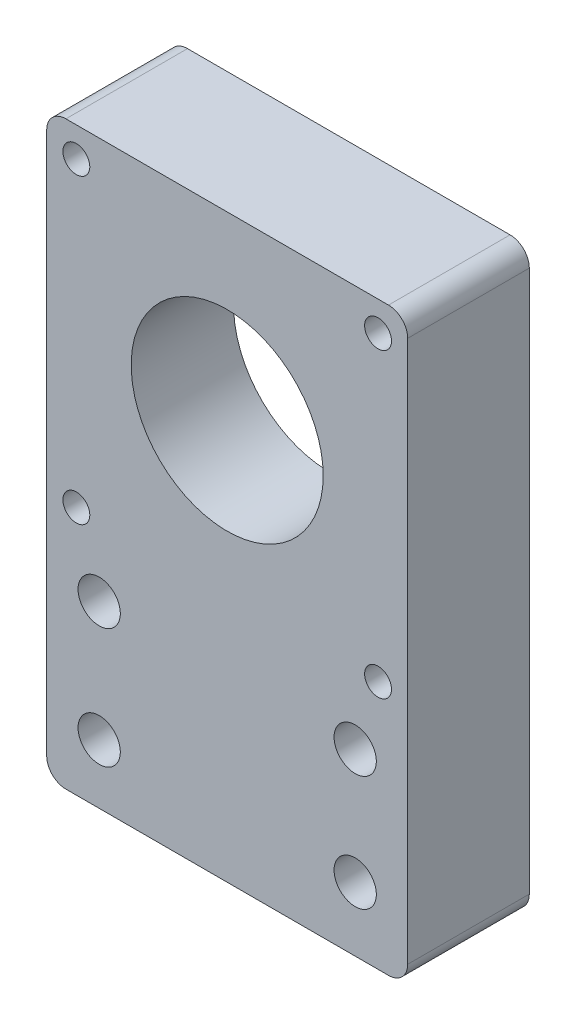
ISO-10303-21;
HEADER;
FILE_DESCRIPTION(('STEP AP214'),'2;1');
FILE_NAME('part.step','',(''),(''),'','','');
FILE_SCHEMA(('AUTOMOTIVE_DESIGN { 1 0 10303 214 1 1 1 1 }'));
ENDSEC;
DATA;
#1=APPLICATION_CONTEXT('core data for automotive mechanical design processes');
#2=APPLICATION_PROTOCOL_DEFINITION('international standard','automotive_design',2000,#1);
#3=PRODUCT_CONTEXT('',#1,'mechanical');
#4=PRODUCT('Part','Part','',(#3));
#5=PRODUCT_RELATED_PRODUCT_CATEGORY('part','',(#4));
#6=PRODUCT_DEFINITION_FORMATION('','',#4);
#7=PRODUCT_DEFINITION_CONTEXT('part definition',#1,'design');
#8=PRODUCT_DEFINITION('design','',#6,#7);
#9=PRODUCT_DEFINITION_SHAPE('','',#8);
#10=(LENGTH_UNIT() NAMED_UNIT(*) SI_UNIT(.MILLI.,.METRE.));
#11=(NAMED_UNIT(*) PLANE_ANGLE_UNIT() SI_UNIT($,.RADIAN.));
#12=(NAMED_UNIT(*) SI_UNIT($,.STERADIAN.) SOLID_ANGLE_UNIT());
#13=UNCERTAINTY_MEASURE_WITH_UNIT(LENGTH_MEASURE(1.E-05),#10,'distance_accuracy_value','');
#14=(GEOMETRIC_REPRESENTATION_CONTEXT(3) GLOBAL_UNCERTAINTY_ASSIGNED_CONTEXT((#13)) GLOBAL_UNIT_ASSIGNED_CONTEXT((#10,
#11,#12)) REPRESENTATION_CONTEXT('',''));
#15=CARTESIAN_POINT('',(0.,0.,0.));
#16=DIRECTION('',(0.,0.,1.));
#17=DIRECTION('',(1.,0.,0.));
#18=AXIS2_PLACEMENT_3D('',#15,#16,#17);
#19=CARTESIAN_POINT('',(-1.13805060393229E-10,25.0000000000021,-1.));
#20=DIRECTION('',(0.,0.,1.));
#21=DIRECTION('',(1.,0.,0.));
#22=AXIS2_PLACEMENT_3D('',#19,#20,#21);
#23=CYLINDRICAL_SURFACE('',#22,20.9043555487387);
#24=CARTESIAN_POINT('',(-1.13805060393229E-10,25.0000000000021,0.));
#25=DIRECTION('',(0.,0.,-1.));
#26=DIRECTION('',(-1.,0.,0.));
#27=AXIS2_PLACEMENT_3D('',#24,#25,#26);
#28=CIRCLE('',#27,20.9043555487387);
#29=CARTESIAN_POINT('',(-20.9043555488525,25.0000000000021,0.));
#30=VERTEX_POINT('',#29);
#31=EDGE_CURVE('E135',#30,#30,#28,.T.);
#32=ORIENTED_EDGE('',*,*,#31,.T.);
#33=EDGE_LOOP('',(#32));
#34=FACE_BOUND('',#33,.T.);
#35=CARTESIAN_POINT('',(-1.13805060393229E-10,25.0000000000021,3.));
#36=DIRECTION('',(0.,0.,1.));
#37=DIRECTION('',(1.,0.,0.));
#38=AXIS2_PLACEMENT_3D('',#35,#36,#37);
#39=CIRCLE('',#38,20.9043555487387);
#40=CARTESIAN_POINT('',(20.9043555486249,25.0000000000021,3.));
#41=VERTEX_POINT('',#40);
#42=EDGE_CURVE('E11',#41,#41,#39,.F.);
#43=ORIENTED_EDGE('',*,*,#42,.F.);
#44=EDGE_LOOP('',(#43));
#45=FACE_BOUND('',#44,.T.);
#46=ADVANCED_FACE('F32',(#34,#45),#23,.F.);
#47=CARTESIAN_POINT('',(-28.2000000001139,53.2000000000001,19.));
#48=DIRECTION('',(0.,-1.,0.));
#49=DIRECTION('',(0.,0.,-1.));
#50=AXIS2_PLACEMENT_3D('',#47,#48,#49);
#51=PLANE('',#50);
#52=DIRECTION('',(-1.,0.,0.));
#53=VECTOR('',#52,1.);
#54=CARTESIAN_POINT('',(-28.2000000001139,53.2000000000001,19.));
#55=LINE('',#54,#53);
#56=CARTESIAN_POINT('',(25.1999999998861,53.2000000000001,19.));
#57=VERTEX_POINT('',#56);
#58=CARTESIAN_POINT('',(-25.2000000001139,53.2000000000001,19.));
#59=VERTEX_POINT('',#58);
#60=EDGE_CURVE('E126',#57,#59,#55,.T.);
#61=ORIENTED_EDGE('',*,*,#60,.F.);
#62=DIRECTION('',(0.,0.,-1.));
#63=VECTOR('',#62,1.);
#64=CARTESIAN_POINT('',(25.1999999998861,53.2000000000001,19.));
#65=LINE('',#64,#63);
#66=CARTESIAN_POINT('',(25.1999999998861,53.2000000000001,0.));
#67=VERTEX_POINT('',#66);
#68=EDGE_CURVE('E40',#57,#67,#65,.T.);
#69=ORIENTED_EDGE('',*,*,#68,.T.);
#70=DIRECTION('',(-1.,0.,0.));
#71=VECTOR('',#70,1.);
#72=CARTESIAN_POINT('',(-28.2000000001139,53.2000000000001,0.));
#73=LINE('',#72,#71);
#74=CARTESIAN_POINT('',(-25.2000000001139,53.2000000000001,0.));
#75=VERTEX_POINT('',#74);
#76=EDGE_CURVE('E131',#67,#75,#73,.T.);
#77=ORIENTED_EDGE('',*,*,#76,.T.);
#78=DIRECTION('',(0.,0.,-1.));
#79=VECTOR('',#78,1.);
#80=CARTESIAN_POINT('',(-25.2000000001139,53.2000000000001,19.));
#81=LINE('',#80,#79);
#82=EDGE_CURVE('E157',#75,#59,#81,.F.);
#83=ORIENTED_EDGE('',*,*,#82,.T.);
#84=EDGE_LOOP('',(#61,#69,#77,#83));
#85=FACE_BOUND('',#84,.T.);
#86=ADVANCED_FACE('F163',(#85),#51,.F.);
#87=CARTESIAN_POINT('',(-28.2000000001139,-3.19999999999987,19.));
#88=DIRECTION('',(1.,0.,0.));
#89=DIRECTION('',(0.,1.,0.));
#90=AXIS2_PLACEMENT_3D('',#87,#88,#89);
#91=PLANE('',#90);
#92=DIRECTION('',(0.,-1.,0.));
#93=VECTOR('',#92,1.);
#94=CARTESIAN_POINT('',(-28.2000000001139,-3.19999999999987,0.));
#95=LINE('',#94,#93);
#96=CARTESIAN_POINT('',(-28.2000000001139,50.2000000000001,0.));
#97=VERTEX_POINT('',#96);
#98=CARTESIAN_POINT('',(-28.2000000001139,-34.4999999999999,0.));
#99=VERTEX_POINT('',#98);
#100=EDGE_CURVE('E127',#97,#99,#95,.T.);
#101=ORIENTED_EDGE('',*,*,#100,.T.);
#102=DIRECTION('',(0.,0.,-1.));
#103=VECTOR('',#102,1.);
#104=CARTESIAN_POINT('',(-28.2000000001139,-34.4999999999999,19.));
#105=LINE('',#104,#103);
#106=CARTESIAN_POINT('',(-28.2000000001139,-34.4999999999999,19.));
#107=VERTEX_POINT('',#106);
#108=EDGE_CURVE('E47',#99,#107,#105,.F.);
#109=ORIENTED_EDGE('',*,*,#108,.T.);
#110=DIRECTION('',(0.,-1.,0.));
#111=VECTOR('',#110,1.);
#112=CARTESIAN_POINT('',(-28.2000000001139,-3.19999999999987,19.));
#113=LINE('',#112,#111);
#114=CARTESIAN_POINT('',(-28.2000000001139,50.2000000000001,19.));
#115=VERTEX_POINT('',#114);
#116=EDGE_CURVE('E129',#115,#107,#113,.T.);
#117=ORIENTED_EDGE('',*,*,#116,.F.);
#118=DIRECTION('',(0.,0.,-1.));
#119=VECTOR('',#118,1.);
#120=CARTESIAN_POINT('',(-28.2000000001139,50.2000000000001,19.));
#121=LINE('',#120,#119);
#122=EDGE_CURVE('E153',#115,#97,#121,.T.);
#123=ORIENTED_EDGE('',*,*,#122,.T.);
#124=EDGE_LOOP('',(#101,#109,#117,#123));
#125=FACE_BOUND('',#124,.T.);
#126=ADVANCED_FACE('F250',(#125),#91,.F.);
#127=CARTESIAN_POINT('',(28.1999999998861,53.2000000000001,19.));
#128=DIRECTION('',(-1.,0.,0.));
#129=DIRECTION('',(0.,-1.,0.));
#130=AXIS2_PLACEMENT_3D('',#127,#128,#129);
#131=PLANE('',#130);
#132=DIRECTION('',(0.,1.,0.));
#133=VECTOR('',#132,1.);
#134=CARTESIAN_POINT('',(28.1999999998861,53.2000000000001,19.));
#135=LINE('',#134,#133);
#136=CARTESIAN_POINT('',(28.1999999998861,-34.4999999999999,19.));
#137=VERTEX_POINT('',#136);
#138=CARTESIAN_POINT('',(28.1999999998861,50.2000000000001,19.));
#139=VERTEX_POINT('',#138);
#140=EDGE_CURVE('E119',#137,#139,#135,.T.);
#141=ORIENTED_EDGE('',*,*,#140,.F.);
#142=DIRECTION('',(0.,0.,-1.));
#143=VECTOR('',#142,1.);
#144=CARTESIAN_POINT('',(28.1999999998861,-34.4999999999999,0.));
#145=LINE('',#144,#143);
#146=CARTESIAN_POINT('',(28.1999999998861,-34.4999999999999,0.));
#147=VERTEX_POINT('',#146);
#148=EDGE_CURVE('E103',#137,#147,#145,.T.);
#149=ORIENTED_EDGE('',*,*,#148,.T.);
#150=DIRECTION('',(0.,1.,0.));
#151=VECTOR('',#150,1.);
#152=CARTESIAN_POINT('',(28.1999999998861,53.2000000000001,0.));
#153=LINE('',#152,#151);
#154=CARTESIAN_POINT('',(28.1999999998861,50.2000000000001,0.));
#155=VERTEX_POINT('',#154);
#156=EDGE_CURVE('E116',#147,#155,#153,.T.);
#157=ORIENTED_EDGE('',*,*,#156,.T.);
#158=DIRECTION('',(0.,0.,-1.));
#159=VECTOR('',#158,1.);
#160=CARTESIAN_POINT('',(28.1999999998861,50.2000000000001,19.));
#161=LINE('',#160,#159);
#162=EDGE_CURVE('E121',#155,#139,#161,.F.);
#163=ORIENTED_EDGE('',*,*,#162,.T.);
#164=EDGE_LOOP('',(#141,#149,#157,#163));
#165=FACE_BOUND('',#164,.T.);
#166=ADVANCED_FACE('F115',(#165),#131,.F.);
#167=CARTESIAN_POINT('',(0.,0.,19.));
#168=DIRECTION('',(0.,0.,-1.));
#169=DIRECTION('',(-1.,0.,0.));
#170=AXIS2_PLACEMENT_3D('',#167,#168,#169);
#171=PLANE('',#170);
#172=CARTESIAN_POINT('',(19.9999999998865,-9.49999999999986,19.));
#173=DIRECTION('',(0.,0.,-1.));
#174=DIRECTION('',(-1.,0.,0.));
#175=AXIS2_PLACEMENT_3D('',#172,#173,#174);
#176=CIRCLE('',#175,3.29999999999999);
#177=CARTESIAN_POINT('',(16.6999999998865,-9.49999999999986,19.));
#178=VERTEX_POINT('',#177);
#179=EDGE_CURVE('E217',#178,#178,#176,.T.);
#180=ORIENTED_EDGE('',*,*,#179,.T.);
#181=EDGE_LOOP('',(#180));
#182=FACE_BOUND('',#181,.T.);
#183=CARTESIAN_POINT('',(19.9999999998865,-27.4999999999999,19.));
#184=DIRECTION('',(0.,0.,-1.));
#185=DIRECTION('',(-1.,0.,0.));
#186=AXIS2_PLACEMENT_3D('',#183,#184,#185);
#187=CIRCLE('',#186,3.29999999999999);
#188=CARTESIAN_POINT('',(16.6999999998865,-27.4999999999999,19.));
#189=VERTEX_POINT('',#188);
#190=EDGE_CURVE('E211',#189,#189,#187,.T.);
#191=ORIENTED_EDGE('',*,*,#190,.T.);
#192=EDGE_LOOP('',(#191));
#193=FACE_BOUND('',#192,.T.);
#194=CARTESIAN_POINT('',(-20.0000000001135,-28.2376577347049,19.));
#195=DIRECTION('',(0.,0.,-1.));
#196=DIRECTION('',(-1.,0.,0.));
#197=AXIS2_PLACEMENT_3D('',#194,#195,#196);
#198=CIRCLE('',#197,3.29999999999999);
#199=CARTESIAN_POINT('',(-23.3000000001135,-28.2376577347049,19.));
#200=VERTEX_POINT('',#199);
#201=EDGE_CURVE('E205',#200,#200,#198,.T.);
#202=ORIENTED_EDGE('',*,*,#201,.T.);
#203=EDGE_LOOP('',(#202));
#204=FACE_BOUND('',#203,.T.);
#205=CARTESIAN_POINT('',(-20.0000000001135,-9.49999999999986,19.));
#206=DIRECTION('',(0.,0.,-1.));
#207=DIRECTION('',(-1.,0.,0.));
#208=AXIS2_PLACEMENT_3D('',#205,#206,#207);
#209=CIRCLE('',#208,3.29999999999999);
#210=CARTESIAN_POINT('',(-23.3000000001135,-9.49999999999986,19.));
#211=VERTEX_POINT('',#210);
#212=EDGE_CURVE('E199',#211,#211,#209,.T.);
#213=ORIENTED_EDGE('',*,*,#212,.T.);
#214=EDGE_LOOP('',(#213));
#215=FACE_BOUND('',#214,.T.);
#216=CARTESIAN_POINT('',(23.5699999998861,48.5700000000001,19.));
#217=DIRECTION('',(0.,0.,-1.));
#218=DIRECTION('',(-1.,0.,0.));
#219=AXIS2_PLACEMENT_3D('',#216,#217,#218);
#220=CIRCLE('',#219,2.09999999999999);
#221=CARTESIAN_POINT('',(21.4699999998861,48.5700000000001,19.));
#222=VERTEX_POINT('',#221);
#223=EDGE_CURVE('E193',#222,#222,#220,.T.);
#224=ORIENTED_EDGE('',*,*,#223,.T.);
#225=EDGE_LOOP('',(#224));
#226=FACE_BOUND('',#225,.T.);
#227=CARTESIAN_POINT('',(-23.5700000001139,48.5700000000001,19.));
#228=DIRECTION('',(0.,0.,-1.));
#229=DIRECTION('',(-1.,0.,0.));
#230=AXIS2_PLACEMENT_3D('',#227,#228,#229);
#231=CIRCLE('',#230,2.09999999999999);
#232=CARTESIAN_POINT('',(-25.6700000001139,48.5700000000001,19.));
#233=VERTEX_POINT('',#232);
#234=EDGE_CURVE('E187',#233,#233,#231,.T.);
#235=ORIENTED_EDGE('',*,*,#234,.T.);
#236=EDGE_LOOP('',(#235));
#237=FACE_BOUND('',#236,.T.);
#238=CARTESIAN_POINT('',(23.5699999998861,1.43000000000014,19.));
#239=DIRECTION('',(0.,0.,-1.));
#240=DIRECTION('',(-1.,0.,0.));
#241=AXIS2_PLACEMENT_3D('',#238,#239,#240);
#242=CIRCLE('',#241,2.09999999999999);
#243=CARTESIAN_POINT('',(21.4699999998861,1.43000000000014,19.));
#244=VERTEX_POINT('',#243);
#245=EDGE_CURVE('E181',#244,#244,#242,.T.);
#246=ORIENTED_EDGE('',*,*,#245,.T.);
#247=EDGE_LOOP('',(#246));
#248=FACE_BOUND('',#247,.T.);
#249=CARTESIAN_POINT('',(-23.5700000001139,1.43000000000014,19.));
#250=DIRECTION('',(0.,0.,-1.));
#251=DIRECTION('',(-1.,0.,0.));
#252=AXIS2_PLACEMENT_3D('',#249,#250,#251);
#253=CIRCLE('',#252,2.09999999999999);
#254=CARTESIAN_POINT('',(-25.6700000001139,1.43000000000014,19.));
#255=VERTEX_POINT('',#254);
#256=EDGE_CURVE('E173',#255,#255,#253,.T.);
#257=ORIENTED_EDGE('',*,*,#256,.T.);
#258=EDGE_LOOP('',(#257));
#259=FACE_BOUND('',#258,.T.);
#260=DIRECTION('',(-1.,0.,0.));
#261=VECTOR('',#260,1.);
#262=CARTESIAN_POINT('',(28.1999999998861,-37.4999999999999,19.));
#263=LINE('',#262,#261);
#264=CARTESIAN_POINT('',(25.1999999998861,-37.4999999999999,19.));
#265=VERTEX_POINT('',#264);
#266=CARTESIAN_POINT('',(-25.2000000001139,-37.4999999999999,19.));
#267=VERTEX_POINT('',#266);
#268=EDGE_CURVE('E138',#265,#267,#263,.T.);
#269=ORIENTED_EDGE('',*,*,#268,.F.);
#270=CARTESIAN_POINT('',(25.1999999998861,-34.4999999999999,19.));
#271=DIRECTION('',(0.,0.,-1.));
#272=DIRECTION('',(-1.,0.,0.));
#273=AXIS2_PLACEMENT_3D('',#270,#271,#272);
#274=CIRCLE('',#273,3.);
#275=EDGE_CURVE('E151',#265,#137,#274,.F.);
#276=ORIENTED_EDGE('',*,*,#275,.T.);
#277=ORIENTED_EDGE('',*,*,#140,.T.);
#278=CARTESIAN_POINT('',(25.1999999998861,50.2000000000001,19.));
#279=DIRECTION('',(0.,0.,-1.));
#280=DIRECTION('',(-1.,0.,0.));
#281=AXIS2_PLACEMENT_3D('',#278,#279,#280);
#282=CIRCLE('',#281,3.);
#283=EDGE_CURVE('E147',#139,#57,#282,.F.);
#284=ORIENTED_EDGE('',*,*,#283,.T.);
#285=ORIENTED_EDGE('',*,*,#60,.T.);
#286=CARTESIAN_POINT('',(-25.2000000001139,50.2000000000001,19.));
#287=DIRECTION('',(0.,0.,-1.));
#288=DIRECTION('',(-1.,0.,0.));
#289=AXIS2_PLACEMENT_3D('',#286,#287,#288);
#290=CIRCLE('',#289,3.);
#291=EDGE_CURVE('E54',#59,#115,#290,.F.);
#292=ORIENTED_EDGE('',*,*,#291,.T.);
#293=ORIENTED_EDGE('',*,*,#116,.T.);
#294=CARTESIAN_POINT('',(-25.2000000001139,-34.4999999999999,19.));
#295=DIRECTION('',(0.,0.,-1.));
#296=DIRECTION('',(-1.,0.,0.));
#297=AXIS2_PLACEMENT_3D('',#294,#295,#296);
#298=CIRCLE('',#297,3.);
#299=EDGE_CURVE('E149',#107,#267,#298,.F.);
#300=ORIENTED_EDGE('',*,*,#299,.T.);
#301=EDGE_LOOP('',(#269,#276,#277,#284,#285,#292,#293,#300));
#302=FACE_BOUND('',#301,.T.);
#303=CARTESIAN_POINT('',(-1.13805060393229E-10,25.0000000000021,19.));
#304=DIRECTION('',(0.,0.,1.));
#305=DIRECTION('',(1.,0.,0.));
#306=AXIS2_PLACEMENT_3D('',#303,#304,#305);
#307=CIRCLE('',#306,15.);
#308=CARTESIAN_POINT('',(14.9999999998862,25.0000000000021,19.));
#309=VERTEX_POINT('',#308);
#310=EDGE_CURVE('E224',#309,#309,#307,.T.);
#311=ORIENTED_EDGE('',*,*,#310,.F.);
#312=EDGE_LOOP('',(#311));
#313=FACE_BOUND('',#312,.T.);
#314=ADVANCED_FACE('F239',(#182,#193,#204,#215,#226,#237,#248,#259,#302,#313),#171,.F.);
#315=CARTESIAN_POINT('',(0.,0.,0.));
#316=DIRECTION('',(0.,0.,-1.));
#317=DIRECTION('',(-1.,0.,0.));
#318=AXIS2_PLACEMENT_3D('',#315,#316,#317);
#319=PLANE('',#318);
#320=CARTESIAN_POINT('',(19.9999999998865,-9.49999999999986,0.));
#321=DIRECTION('',(0.,0.,-1.));
#322=DIRECTION('',(-1.,0.,0.));
#323=AXIS2_PLACEMENT_3D('',#320,#321,#322);
#324=CIRCLE('',#323,3.3);
#325=CARTESIAN_POINT('',(16.6999999998865,-9.49999999999986,0.));
#326=VERTEX_POINT('',#325);
#327=EDGE_CURVE('E220',#326,#326,#324,.T.);
#328=ORIENTED_EDGE('',*,*,#327,.F.);
#329=EDGE_LOOP('',(#328));
#330=FACE_BOUND('',#329,.T.);
#331=CARTESIAN_POINT('',(19.9999999998865,-27.4999999999999,0.));
#332=DIRECTION('',(0.,0.,-1.));
#333=DIRECTION('',(-1.,0.,0.));
#334=AXIS2_PLACEMENT_3D('',#331,#332,#333);
#335=CIRCLE('',#334,3.3);
#336=CARTESIAN_POINT('',(16.6999999998865,-27.4999999999999,0.));
#337=VERTEX_POINT('',#336);
#338=EDGE_CURVE('E214',#337,#337,#335,.T.);
#339=ORIENTED_EDGE('',*,*,#338,.F.);
#340=EDGE_LOOP('',(#339));
#341=FACE_BOUND('',#340,.T.);
#342=CARTESIAN_POINT('',(-20.0000000001135,-28.2376577347049,0.));
#343=DIRECTION('',(0.,0.,-1.));
#344=DIRECTION('',(-1.,0.,0.));
#345=AXIS2_PLACEMENT_3D('',#342,#343,#344);
#346=CIRCLE('',#345,3.3);
#347=CARTESIAN_POINT('',(-23.3000000001135,-28.2376577347049,0.));
#348=VERTEX_POINT('',#347);
#349=EDGE_CURVE('E208',#348,#348,#346,.T.);
#350=ORIENTED_EDGE('',*,*,#349,.F.);
#351=EDGE_LOOP('',(#350));
#352=FACE_BOUND('',#351,.T.);
#353=CARTESIAN_POINT('',(-20.0000000001135,-9.49999999999986,0.));
#354=DIRECTION('',(0.,0.,-1.));
#355=DIRECTION('',(-1.,0.,0.));
#356=AXIS2_PLACEMENT_3D('',#353,#354,#355);
#357=CIRCLE('',#356,3.3);
#358=CARTESIAN_POINT('',(-23.3000000001135,-9.49999999999986,0.));
#359=VERTEX_POINT('',#358);
#360=EDGE_CURVE('E202',#359,#359,#357,.T.);
#361=ORIENTED_EDGE('',*,*,#360,.F.);
#362=EDGE_LOOP('',(#361));
#363=FACE_BOUND('',#362,.T.);
#364=CARTESIAN_POINT('',(23.5699999998861,48.5700000000001,0.));
#365=DIRECTION('',(0.,0.,-1.));
#366=DIRECTION('',(-1.,0.,0.));
#367=AXIS2_PLACEMENT_3D('',#364,#365,#366);
#368=CIRCLE('',#367,2.1);
#369=CARTESIAN_POINT('',(21.4699999998861,48.5700000000001,0.));
#370=VERTEX_POINT('',#369);
#371=EDGE_CURVE('E196',#370,#370,#368,.T.);
#372=ORIENTED_EDGE('',*,*,#371,.F.);
#373=EDGE_LOOP('',(#372));
#374=FACE_BOUND('',#373,.T.);
#375=CARTESIAN_POINT('',(-23.5700000001139,48.5700000000001,0.));
#376=DIRECTION('',(0.,0.,-1.));
#377=DIRECTION('',(-1.,0.,0.));
#378=AXIS2_PLACEMENT_3D('',#375,#376,#377);
#379=CIRCLE('',#378,2.1);
#380=CARTESIAN_POINT('',(-25.6700000001139,48.5700000000001,0.));
#381=VERTEX_POINT('',#380);
#382=EDGE_CURVE('E190',#381,#381,#379,.T.);
#383=ORIENTED_EDGE('',*,*,#382,.F.);
#384=EDGE_LOOP('',(#383));
#385=FACE_BOUND('',#384,.T.);
#386=CARTESIAN_POINT('',(23.5699999998861,1.43000000000014,0.));
#387=DIRECTION('',(0.,0.,-1.));
#388=DIRECTION('',(-1.,0.,0.));
#389=AXIS2_PLACEMENT_3D('',#386,#387,#388);
#390=CIRCLE('',#389,2.1);
#391=CARTESIAN_POINT('',(21.4699999998861,1.43000000000014,0.));
#392=VERTEX_POINT('',#391);
#393=EDGE_CURVE('E184',#392,#392,#390,.T.);
#394=ORIENTED_EDGE('',*,*,#393,.F.);
#395=EDGE_LOOP('',(#394));
#396=FACE_BOUND('',#395,.T.);
#397=CARTESIAN_POINT('',(-23.5700000001139,1.43000000000014,0.));
#398=DIRECTION('',(0.,0.,-1.));
#399=DIRECTION('',(-1.,0.,0.));
#400=AXIS2_PLACEMENT_3D('',#397,#398,#399);
#401=CIRCLE('',#400,2.1);
#402=CARTESIAN_POINT('',(-25.6700000001139,1.43000000000014,0.));
#403=VERTEX_POINT('',#402);
#404=EDGE_CURVE('E178',#403,#403,#401,.T.);
#405=ORIENTED_EDGE('',*,*,#404,.F.);
#406=EDGE_LOOP('',(#405));
#407=FACE_BOUND('',#406,.T.);
#408=ORIENTED_EDGE('',*,*,#31,.F.);
#409=EDGE_LOOP('',(#408));
#410=FACE_BOUND('',#409,.T.);
#411=ORIENTED_EDGE('',*,*,#156,.F.);
#412=CARTESIAN_POINT('',(25.1999999998861,-34.4999999999999,0.));
#413=DIRECTION('',(0.,0.,-1.));
#414=DIRECTION('',(-1.,0.,0.));
#415=AXIS2_PLACEMENT_3D('',#412,#413,#414);
#416=CIRCLE('',#415,3.);
#417=CARTESIAN_POINT('',(25.1999999998861,-37.4999999999999,0.));
#418=VERTEX_POINT('',#417);
#419=EDGE_CURVE('E99',#147,#418,#416,.T.);
#420=ORIENTED_EDGE('',*,*,#419,.T.);
#421=DIRECTION('',(-1.,0.,0.));
#422=VECTOR('',#421,1.);
#423=CARTESIAN_POINT('',(28.1999999998861,-37.4999999999999,0.));
#424=LINE('',#423,#422);
#425=CARTESIAN_POINT('',(-25.2000000001139,-37.4999999999999,0.));
#426=VERTEX_POINT('',#425);
#427=EDGE_CURVE('E171',#418,#426,#424,.T.);
#428=ORIENTED_EDGE('',*,*,#427,.T.);
#429=CARTESIAN_POINT('',(-25.2000000001139,-34.4999999999999,0.));
#430=DIRECTION('',(0.,0.,-1.));
#431=DIRECTION('',(-1.,0.,0.));
#432=AXIS2_PLACEMENT_3D('',#429,#430,#431);
#433=CIRCLE('',#432,3.);
#434=EDGE_CURVE('E110',#426,#99,#433,.T.);
#435=ORIENTED_EDGE('',*,*,#434,.T.);
#436=ORIENTED_EDGE('',*,*,#100,.F.);
#437=CARTESIAN_POINT('',(-25.2000000001139,50.2000000000001,0.));
#438=DIRECTION('',(0.,0.,-1.));
#439=DIRECTION('',(-1.,0.,0.));
#440=AXIS2_PLACEMENT_3D('',#437,#438,#439);
#441=CIRCLE('',#440,3.);
#442=EDGE_CURVE('E120',#97,#75,#441,.T.);
#443=ORIENTED_EDGE('',*,*,#442,.T.);
#444=ORIENTED_EDGE('',*,*,#76,.F.);
#445=CARTESIAN_POINT('',(25.1999999998861,50.2000000000001,0.));
#446=DIRECTION('',(0.,0.,-1.));
#447=DIRECTION('',(-1.,0.,0.));
#448=AXIS2_PLACEMENT_3D('',#445,#446,#447);
#449=CIRCLE('',#448,3.);
#450=EDGE_CURVE('E125',#67,#155,#449,.T.);
#451=ORIENTED_EDGE('',*,*,#450,.T.);
#452=EDGE_LOOP('',(#411,#420,#428,#435,#436,#443,#444,#451));
#453=FACE_BOUND('',#452,.T.);
#454=ADVANCED_FACE('F123',(#330,#341,#352,#363,#374,#385,#396,#407,#410,#453),#319,.T.);
#455=CARTESIAN_POINT('',(28.1999999998861,-37.4999999999999,19.));
#456=DIRECTION('',(0.,-1.,0.));
#457=DIRECTION('',(0.,0.,-1.));
#458=AXIS2_PLACEMENT_3D('',#455,#456,#457);
#459=PLANE('',#458);
#460=ORIENTED_EDGE('',*,*,#427,.F.);
#461=DIRECTION('',(0.,0.,-1.));
#462=VECTOR('',#461,1.);
#463=CARTESIAN_POINT('',(25.1999999998861,-37.4999999999999,19.));
#464=LINE('',#463,#462);
#465=EDGE_CURVE('E104',#418,#265,#464,.F.);
#466=ORIENTED_EDGE('',*,*,#465,.T.);
#467=ORIENTED_EDGE('',*,*,#268,.T.);
#468=DIRECTION('',(0.,0.,-1.));
#469=VECTOR('',#468,1.);
#470=CARTESIAN_POINT('',(-25.2000000001139,-37.4999999999999,0.));
#471=LINE('',#470,#469);
#472=EDGE_CURVE('E109',#267,#426,#471,.T.);
#473=ORIENTED_EDGE('',*,*,#472,.T.);
#474=EDGE_LOOP('',(#460,#466,#467,#473));
#475=FACE_BOUND('',#474,.T.);
#476=ADVANCED_FACE('F247',(#475),#459,.T.);
#477=CARTESIAN_POINT('',(25.1999999998861,-34.4999999999999,19.));
#478=DIRECTION('',(0.,0.,1.));
#479=DIRECTION('',(1.,0.,0.));
#480=AXIS2_PLACEMENT_3D('',#477,#478,#479);
#481=CYLINDRICAL_SURFACE('',#480,3.);
#482=ORIENTED_EDGE('',*,*,#275,.F.);
#483=ORIENTED_EDGE('',*,*,#465,.F.);
#484=ORIENTED_EDGE('',*,*,#419,.F.);
#485=ORIENTED_EDGE('',*,*,#148,.F.);
#486=EDGE_LOOP('',(#482,#483,#484,#485));
#487=FACE_BOUND('',#486,.T.);
#488=ADVANCED_FACE('F102',(#487),#481,.T.);
#489=CARTESIAN_POINT('',(-25.2000000001139,-34.4999999999999,19.));
#490=DIRECTION('',(0.,0.,1.));
#491=DIRECTION('',(1.,0.,0.));
#492=AXIS2_PLACEMENT_3D('',#489,#490,#491);
#493=CYLINDRICAL_SURFACE('',#492,3.);
#494=ORIENTED_EDGE('',*,*,#299,.F.);
#495=ORIENTED_EDGE('',*,*,#108,.F.);
#496=ORIENTED_EDGE('',*,*,#434,.F.);
#497=ORIENTED_EDGE('',*,*,#472,.F.);
#498=EDGE_LOOP('',(#494,#495,#496,#497));
#499=FACE_BOUND('',#498,.T.);
#500=ADVANCED_FACE('F380',(#499),#493,.T.);
#501=CARTESIAN_POINT('',(25.1999999998861,50.2000000000001,19.));
#502=DIRECTION('',(0.,0.,-1.));
#503=DIRECTION('',(-1.,0.,0.));
#504=AXIS2_PLACEMENT_3D('',#501,#502,#503);
#505=CYLINDRICAL_SURFACE('',#504,3.);
#506=ORIENTED_EDGE('',*,*,#283,.F.);
#507=ORIENTED_EDGE('',*,*,#162,.F.);
#508=ORIENTED_EDGE('',*,*,#450,.F.);
#509=ORIENTED_EDGE('',*,*,#68,.F.);
#510=EDGE_LOOP('',(#506,#507,#508,#509));
#511=FACE_BOUND('',#510,.T.);
#512=ADVANCED_FACE('F372',(#511),#505,.T.);
#513=CARTESIAN_POINT('',(-25.2000000001139,50.2000000000001,19.));
#514=DIRECTION('',(0.,0.,-1.));
#515=DIRECTION('',(-1.,0.,0.));
#516=AXIS2_PLACEMENT_3D('',#513,#514,#515);
#517=CYLINDRICAL_SURFACE('',#516,3.);
#518=ORIENTED_EDGE('',*,*,#291,.F.);
#519=ORIENTED_EDGE('',*,*,#82,.F.);
#520=ORIENTED_EDGE('',*,*,#442,.F.);
#521=ORIENTED_EDGE('',*,*,#122,.F.);
#522=EDGE_LOOP('',(#518,#519,#520,#521));
#523=FACE_BOUND('',#522,.T.);
#524=ADVANCED_FACE('F34',(#523),#517,.T.);
#525=CARTESIAN_POINT('',(-23.5700000001139,1.43000000000014,0.));
#526=DIRECTION('',(0.,0.,-1.));
#527=DIRECTION('',(-1.,0.,0.));
#528=AXIS2_PLACEMENT_3D('',#525,#526,#527);
#529=CYLINDRICAL_SURFACE('',#528,2.1);
#530=ORIENTED_EDGE('',*,*,#256,.F.);
#531=EDGE_LOOP('',(#530));
#532=FACE_BOUND('',#531,.T.);
#533=ORIENTED_EDGE('',*,*,#404,.T.);
#534=EDGE_LOOP('',(#533));
#535=FACE_BOUND('',#534,.T.);
#536=ADVANCED_FACE('F265',(#532,#535),#529,.F.);
#537=CARTESIAN_POINT('',(23.5699999998861,1.43000000000014,0.));
#538=DIRECTION('',(0.,0.,-1.));
#539=DIRECTION('',(-1.,0.,0.));
#540=AXIS2_PLACEMENT_3D('',#537,#538,#539);
#541=CYLINDRICAL_SURFACE('',#540,2.1);
#542=ORIENTED_EDGE('',*,*,#245,.F.);
#543=EDGE_LOOP('',(#542));
#544=FACE_BOUND('',#543,.T.);
#545=ORIENTED_EDGE('',*,*,#393,.T.);
#546=EDGE_LOOP('',(#545));
#547=FACE_BOUND('',#546,.T.);
#548=ADVANCED_FACE('F268',(#544,#547),#541,.F.);
#549=CARTESIAN_POINT('',(-23.5700000001139,48.5700000000001,0.));
#550=DIRECTION('',(0.,0.,-1.));
#551=DIRECTION('',(-1.,0.,0.));
#552=AXIS2_PLACEMENT_3D('',#549,#550,#551);
#553=CYLINDRICAL_SURFACE('',#552,2.1);
#554=ORIENTED_EDGE('',*,*,#234,.F.);
#555=EDGE_LOOP('',(#554));
#556=FACE_BOUND('',#555,.T.);
#557=ORIENTED_EDGE('',*,*,#382,.T.);
#558=EDGE_LOOP('',(#557));
#559=FACE_BOUND('',#558,.T.);
#560=ADVANCED_FACE('F272',(#556,#559),#553,.F.);
#561=CARTESIAN_POINT('',(23.5699999998861,48.5700000000001,0.));
#562=DIRECTION('',(0.,0.,-1.));
#563=DIRECTION('',(-1.,0.,0.));
#564=AXIS2_PLACEMENT_3D('',#561,#562,#563);
#565=CYLINDRICAL_SURFACE('',#564,2.1);
#566=ORIENTED_EDGE('',*,*,#223,.F.);
#567=EDGE_LOOP('',(#566));
#568=FACE_BOUND('',#567,.T.);
#569=ORIENTED_EDGE('',*,*,#371,.T.);
#570=EDGE_LOOP('',(#569));
#571=FACE_BOUND('',#570,.T.);
#572=ADVANCED_FACE('F276',(#568,#571),#565,.F.);
#573=CARTESIAN_POINT('',(-20.0000000001135,-9.49999999999986,0.));
#574=DIRECTION('',(0.,0.,-1.));
#575=DIRECTION('',(-1.,0.,0.));
#576=AXIS2_PLACEMENT_3D('',#573,#574,#575);
#577=CYLINDRICAL_SURFACE('',#576,3.3);
#578=ORIENTED_EDGE('',*,*,#212,.F.);
#579=EDGE_LOOP('',(#578));
#580=FACE_BOUND('',#579,.T.);
#581=ORIENTED_EDGE('',*,*,#360,.T.);
#582=EDGE_LOOP('',(#581));
#583=FACE_BOUND('',#582,.T.);
#584=ADVANCED_FACE('F280',(#580,#583),#577,.F.);
#585=CARTESIAN_POINT('',(-20.0000000001135,-28.2376577347049,0.));
#586=DIRECTION('',(0.,0.,-1.));
#587=DIRECTION('',(-1.,0.,0.));
#588=AXIS2_PLACEMENT_3D('',#585,#586,#587);
#589=CYLINDRICAL_SURFACE('',#588,3.3);
#590=ORIENTED_EDGE('',*,*,#201,.F.);
#591=EDGE_LOOP('',(#590));
#592=FACE_BOUND('',#591,.T.);
#593=ORIENTED_EDGE('',*,*,#349,.T.);
#594=EDGE_LOOP('',(#593));
#595=FACE_BOUND('',#594,.T.);
#596=ADVANCED_FACE('F284',(#592,#595),#589,.F.);
#597=CARTESIAN_POINT('',(19.9999999998865,-27.4999999999999,0.));
#598=DIRECTION('',(0.,0.,-1.));
#599=DIRECTION('',(-1.,0.,0.));
#600=AXIS2_PLACEMENT_3D('',#597,#598,#599);
#601=CYLINDRICAL_SURFACE('',#600,3.3);
#602=ORIENTED_EDGE('',*,*,#190,.F.);
#603=EDGE_LOOP('',(#602));
#604=FACE_BOUND('',#603,.T.);
#605=ORIENTED_EDGE('',*,*,#338,.T.);
#606=EDGE_LOOP('',(#605));
#607=FACE_BOUND('',#606,.T.);
#608=ADVANCED_FACE('F288',(#604,#607),#601,.F.);
#609=CARTESIAN_POINT('',(19.9999999998865,-9.49999999999986,0.));
#610=DIRECTION('',(0.,0.,-1.));
#611=DIRECTION('',(-1.,0.,0.));
#612=AXIS2_PLACEMENT_3D('',#609,#610,#611);
#613=CYLINDRICAL_SURFACE('',#612,3.3);
#614=ORIENTED_EDGE('',*,*,#179,.F.);
#615=EDGE_LOOP('',(#614));
#616=FACE_BOUND('',#615,.T.);
#617=ORIENTED_EDGE('',*,*,#327,.T.);
#618=EDGE_LOOP('',(#617));
#619=FACE_BOUND('',#618,.T.);
#620=ADVANCED_FACE('F292',(#616,#619),#613,.F.);
#621=CARTESIAN_POINT('',(-1.13805060393229E-10,25.0000000000021,3.));
#622=DIRECTION('',(0.,0.,1.));
#623=DIRECTION('',(1.,0.,0.));
#624=AXIS2_PLACEMENT_3D('',#621,#622,#623);
#625=PLANE('',#624);
#626=CARTESIAN_POINT('',(-1.13805060393229E-10,25.0000000000021,3.));
#627=DIRECTION('',(0.,0.,1.));
#628=DIRECTION('',(1.,0.,0.));
#629=AXIS2_PLACEMENT_3D('',#626,#627,#628);
#630=CIRCLE('',#629,15.);
#631=CARTESIAN_POINT('',(14.9999999998862,25.0000000000021,3.));
#632=VERTEX_POINT('',#631);
#633=EDGE_CURVE('E223',#632,#632,#630,.T.);
#634=ORIENTED_EDGE('',*,*,#633,.T.);
#635=EDGE_LOOP('',(#634));
#636=FACE_BOUND('',#635,.T.);
#637=ORIENTED_EDGE('',*,*,#42,.T.);
#638=EDGE_LOOP('',(#637));
#639=FACE_BOUND('',#638,.T.);
#640=ADVANCED_FACE('F230',(#636,#639),#625,.F.);
#641=CARTESIAN_POINT('',(-1.13805060393229E-10,25.0000000000021,3.));
#642=DIRECTION('',(0.,0.,1.));
#643=DIRECTION('',(1.,0.,0.));
#644=AXIS2_PLACEMENT_3D('',#641,#642,#643);
#645=CYLINDRICAL_SURFACE('',#644,15.);
#646=ORIENTED_EDGE('',*,*,#633,.F.);
#647=EDGE_LOOP('',(#646));
#648=FACE_BOUND('',#647,.T.);
#649=ORIENTED_EDGE('',*,*,#310,.T.);
#650=EDGE_LOOP('',(#649));
#651=FACE_BOUND('',#650,.T.);
#652=ADVANCED_FACE('F233',(#648,#651),#645,.F.);
#653=CLOSED_SHELL('',(#46,#86,#126,#166,#314,#454,#476,#488,#500,#512,#524,#536,#548,#560,#572,
#584,#596,#608,#620,#640,#652));
#654=MANIFOLD_SOLID_BREP('B2',#653);
#655=ADVANCED_BREP_SHAPE_REPRESENTATION('',(#18,#654),#14);
#656=SHAPE_DEFINITION_REPRESENTATION(#9,#655);
ENDSEC;
END-ISO-10303-21;
